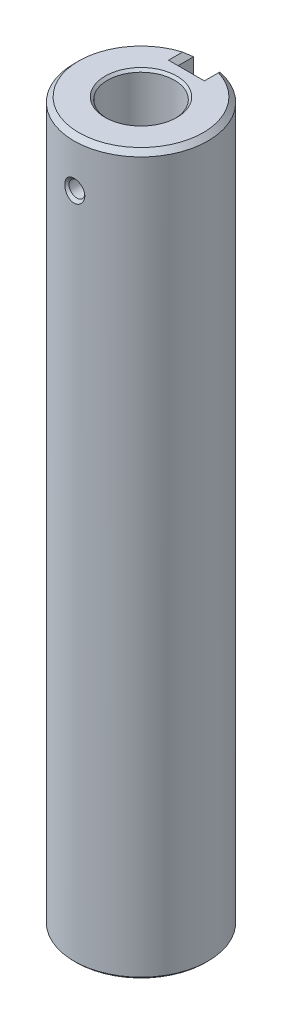
ISO-10303-21;
HEADER;
FILE_DESCRIPTION(('STEP AP214'),'2;1');
FILE_NAME('part.step','',(''),(''),'','','');
FILE_SCHEMA(('AUTOMOTIVE_DESIGN { 1 0 10303 214 1 1 1 1 }'));
ENDSEC;
DATA;
#1=APPLICATION_CONTEXT('core data for automotive mechanical design processes');
#2=APPLICATION_PROTOCOL_DEFINITION('international standard','automotive_design',2000,#1);
#3=PRODUCT_CONTEXT('',#1,'mechanical');
#4=PRODUCT('Part','Part','',(#3));
#5=PRODUCT_RELATED_PRODUCT_CATEGORY('part','',(#4));
#6=PRODUCT_DEFINITION_FORMATION('','',#4);
#7=PRODUCT_DEFINITION_CONTEXT('part definition',#1,'design');
#8=PRODUCT_DEFINITION('design','',#6,#7);
#9=PRODUCT_DEFINITION_SHAPE('','',#8);
#10=(LENGTH_UNIT() NAMED_UNIT(*) SI_UNIT(.MILLI.,.METRE.));
#11=(NAMED_UNIT(*) PLANE_ANGLE_UNIT() SI_UNIT($,.RADIAN.));
#12=(NAMED_UNIT(*) SI_UNIT($,.STERADIAN.) SOLID_ANGLE_UNIT());
#13=UNCERTAINTY_MEASURE_WITH_UNIT(LENGTH_MEASURE(1.E-05),#10,'distance_accuracy_value','');
#14=(GEOMETRIC_REPRESENTATION_CONTEXT(3) GLOBAL_UNCERTAINTY_ASSIGNED_CONTEXT((#13)) GLOBAL_UNIT_ASSIGNED_CONTEXT((#10,
#11,#12)) REPRESENTATION_CONTEXT('',''));
#15=CARTESIAN_POINT('',(0.,0.,0.));
#16=DIRECTION('',(0.,0.,1.));
#17=DIRECTION('',(1.,0.,0.));
#18=AXIS2_PLACEMENT_3D('',#15,#16,#17);
#19=CARTESIAN_POINT('',(0.,150.,0.));
#20=DIRECTION('',(0.,-1.,0.));
#21=DIRECTION('',(0.,0.,-1.));
#22=AXIS2_PLACEMENT_3D('',#19,#20,#21);
#23=CYLINDRICAL_SURFACE('',#22,14.);
#24=CARTESIAN_POINT('',(-1.53135776022729,138.468176963126,13.9159959942111));
#25=CARTESIAN_POINT('',(-1.60127764476214,138.548957642016,13.9083021061078));
#26=CARTESIAN_POINT('',(-1.66533345422651,138.634852905506,13.9007208756863));
#27=CARTESIAN_POINT('',(-1.78077358937562,138.814893823729,13.8864046729967));
#28=CARTESIAN_POINT('',(-1.8321464533701,138.909046837703,13.8796704688696));
#29=CARTESIAN_POINT('',(-1.92996888788323,139.12211198582,13.8664386029846));
#30=CARTESIAN_POINT('',(-1.97363320464747,139.242331559543,13.860228447879));
#31=CARTESIAN_POINT('',(-2.04115702723578,139.488323793423,13.8504456580711));
#32=CARTESIAN_POINT('',(-2.06500845486323,139.614098696633,13.8468740992544));
#33=CARTESIAN_POINT('',(-2.09298715096072,139.872668446938,13.8426739939634));
#34=CARTESIAN_POINT('',(-2.09634077625566,140.005549620874,13.8421608995439));
#35=CARTESIAN_POINT('',(-2.08118716452947,140.270034328525,13.8444470601918));
#36=CARTESIAN_POINT('',(-2.06267853304951,140.401637780201,13.8472465265471));
#37=CARTESIAN_POINT('',(-2.00385336318689,140.661192268973,13.8558817867143));
#38=CARTESIAN_POINT('',(-1.96331849847957,140.789093005199,13.8617479555388));
#39=CARTESIAN_POINT('',(-1.8610882733508,141.036032734745,13.8758422940061));
#40=CARTESIAN_POINT('',(-1.7993923636138,141.15507149792,13.8840705249645));
#41=CARTESIAN_POINT('',(-1.65748223155585,141.378306469293,13.9017175784515));
#42=CARTESIAN_POINT('',(-1.5776406549037,141.482740982984,13.9111109155746));
#43=CARTESIAN_POINT('',(-1.40059493770745,141.675703388028,13.9300476949973));
#44=CARTESIAN_POINT('',(-1.30339610890894,141.764236129135,13.9395910905627));
#45=CARTESIAN_POINT('',(-1.0999170018714,141.917452612588,13.9570775487696));
#46=CARTESIAN_POINT('',(-0.994428442648154,141.983178961701,13.9650797110893));
#47=CARTESIAN_POINT('',(-0.773133020119913,142.094348315229,13.9790739984405));
#48=CARTESIAN_POINT('',(-0.657332390298212,142.139803474743,13.9850673274803));
#49=CARTESIAN_POINT('',(-0.428327101943259,142.205583837824,13.9938787985151));
#50=CARTESIAN_POINT('',(-0.315607150891731,142.227572179828,13.9969056017207));
#51=CARTESIAN_POINT('',(-0.0880285048525289,142.251367596664,14.0001849305751));
#52=CARTESIAN_POINT('',(0.0268294141370945,142.253181856144,14.0004384438823));
#53=CARTESIAN_POINT('',(0.249211116987518,142.23698461402,13.9982013994123));
#54=CARTESIAN_POINT('',(0.356811134085362,142.219975279489,13.9958495447503));
#55=CARTESIAN_POINT('',(0.567640413666256,142.168445480423,13.9888853894585));
#56=CARTESIAN_POINT('',(0.670869639044375,142.133924867263,13.9842730696431));
#57=CARTESIAN_POINT('',(0.871296729335743,142.048301486374,13.9732254623816));
#58=CARTESIAN_POINT('',(0.968423934262403,141.997036303114,13.9667724014763));
#59=CARTESIAN_POINT('',(1.1532880828759,141.879856250496,13.9527250532927));
#60=CARTESIAN_POINT('',(1.24102283340762,141.81393797062,13.9451305004649));
#61=CARTESIAN_POINT('',(1.41028376270478,141.665167417869,13.9290618468448));
#62=CARTESIAN_POINT('',(1.49112308764274,141.581537223889,13.9205623107645));
#63=CARTESIAN_POINT('',(1.63874712127917,141.402652045635,13.903957675865));
#64=CARTESIAN_POINT('',(1.70552733334932,141.307393357478,13.8958527038773));
#65=CARTESIAN_POINT('',(1.82818769716662,141.100538358997,13.8802679531317));
#66=CARTESIAN_POINT('',(1.88292721894083,140.988258352901,13.8728760468477));
#67=CARTESIAN_POINT('',(1.97394595926302,140.756338490784,13.8602184306113));
#68=CARTESIAN_POINT('',(2.01022039243926,140.636696735905,13.854953271895));
#69=CARTESIAN_POINT('',(2.06505190998251,140.386869742714,13.8468906918943));
#70=CARTESIAN_POINT('',(2.08260411797717,140.256458525243,13.8442337938247));
#71=CARTESIAN_POINT('',(2.09627245927023,139.994484997263,13.8421706416678));
#72=CARTESIAN_POINT('',(2.09238539951781,139.862922518205,13.842764871786));
#73=CARTESIAN_POINT('',(2.06295333228332,139.599656131464,13.8471820432034));
#74=CARTESIAN_POINT('',(2.03698336478367,139.468000450473,13.8510683307278));
#75=CARTESIAN_POINT('',(1.96331839276871,139.211010689411,13.8617010339261));
#76=CARTESIAN_POINT('',(1.91562206802214,139.085676994017,13.8684476234084));
#77=CARTESIAN_POINT('',(1.79996028300475,138.846192891427,13.8839297212903));
#78=CARTESIAN_POINT('',(1.73217434096817,138.731954861105,13.8926474587093));
#79=CARTESIAN_POINT('',(1.57760105894847,138.517196760224,13.9110463033582));
#80=CARTESIAN_POINT('',(1.49081689892043,138.416674398477,13.9207272492169));
#81=CARTESIAN_POINT('',(1.30437387879809,138.237031205091,13.9394042422191));
#82=CARTESIAN_POINT('',(1.2054197936225,138.157181839928,13.9484119055677));
#83=CARTESIAN_POINT('',(0.994544195131819,138.016773832754,13.9650285578943));
#84=CARTESIAN_POINT('',(0.882629862947548,137.956204576934,13.972638315448));
#85=CARTESIAN_POINT('',(0.657880600130233,137.860850041201,13.9849528210744));
#86=CARTESIAN_POINT('',(0.545722145073134,137.824492756417,13.9898304105963));
#87=CARTESIAN_POINT('',(0.316638237442721,137.772444103654,13.9968866996364));
#88=CARTESIAN_POINT('',(0.199715209735978,137.756742355457,13.9990667547388));
#89=CARTESIAN_POINT('',(-0.0273628075260393,137.747082906316,14.0004037892334));
#90=CARTESIAN_POINT('',(-0.137461322916733,137.751772604662,13.9997488333666));
#91=CARTESIAN_POINT('',(-0.355247070846229,137.779643843199,13.995915803131));
#92=CARTESIAN_POINT('',(-0.462934261837606,137.802825701761,13.9927376853221));
#93=CARTESIAN_POINT('',(-0.671693957348671,137.866335623105,13.9842639363403));
#94=CARTESIAN_POINT('',(-0.772826536229987,137.906470843267,13.9789921594535));
#95=CARTESIAN_POINT('',(-0.967253953326417,138.002324603407,13.9668862467392));
#96=CARTESIAN_POINT('',(-1.06055160164878,138.058037524917,13.9600526743723));
#97=CARTESIAN_POINT('',(-1.21943577141882,138.170492445145,13.9469709891212));
#98=CARTESIAN_POINT('',(-1.28681335132365,138.224754034039,13.9408833789934));
#99=CARTESIAN_POINT('',(-1.41452195716676,138.34095723969,13.9285046220588));
#100=CARTESIAN_POINT('',(-1.47485461442085,138.402897071605,13.9222135228042));
#101=CARTESIAN_POINT('',(-1.53135776022729,138.468176963126,13.9159959942111));
#102=B_SPLINE_CURVE_WITH_KNOTS('',3,(#24,#25,#26,#27,#28,#29,#30,#31,#32,#33,#34,#35,#36,#37,
#38,#39,#40,#41,#42,#43,#44,#45,#46,#47,#48,#49,#50,#51,#52,#53,#54,#55,#56,#57,#58,#59,#60,#61,
#62,#63,#64,#65,#66,#67,#68,#69,#70,#71,#72,#73,#74,#75,#76,#77,#78,#79,#80,#81,#82,#83,#84,#85,
#86,#87,#88,#89,#90,#91,#92,#93,#94,#95,#96,#97,#98,#99,#100,#101),.UNSPECIFIED.,.T.,.F.,(4,2,2,
2,2,2,2,2,2,2,2,2,2,2,2,2,2,2,2,2,2,2,2,2,2,2,2,2,2,2,2,2,2,2,2,2,2,2,4),(0.,0.321111598311163,
0.642512334418354,1.02491696386992,1.40747743256409,1.80439185218487,2.201331589901,
2.60227957691264,3.00323797284469,3.3966065032665,3.78985485890881,4.16151011353402,
4.53294221399786,4.87582246978047,5.21858061081795,5.54393186724936,5.86928588512925,
6.19789438592273,6.52657945080125,6.87495603822549,7.22344388075731,7.5971862908592,
7.97102550997305,8.36405163147754,8.75713628978807,9.15796118760687,9.55881044533817,
9.95618054845073,10.3534841898444,10.7338858266659,11.1140776866143,11.4662331807764,
11.8182116352824,12.1472118287886,12.4762176866548,12.8015778480361,13.1268208115693,
13.3863753902016,13.6458697469245),.UNSPECIFIED.);
#103=CARTESIAN_POINT('',(-1.53135776022729,138.468176963126,13.9159959942111));
#104=VERTEX_POINT('',#103);
#105=EDGE_CURVE('E245',#104,#104,#102,.T.);
#106=ORIENTED_EDGE('',*,*,#105,.T.);
#107=EDGE_LOOP('',(#106));
#108=FACE_BOUND('',#107,.T.);
#109=CARTESIAN_POINT('',(0.,0.499999999999973,0.));
#110=DIRECTION('',(0.,1.,0.));
#111=DIRECTION('',(0.,0.,1.));
#112=AXIS2_PLACEMENT_3D('',#109,#110,#111);
#113=CIRCLE('',#112,14.);
#114=CARTESIAN_POINT('',(-3.25000000000003,0.499999999999973,-13.6175438313963));
#115=VERTEX_POINT('',#114);
#116=CARTESIAN_POINT('',(3.25000000000003,0.499999999999973,-13.6175438313963));
#117=VERTEX_POINT('',#116);
#118=EDGE_CURVE('E141',#115,#117,#113,.T.);
#119=ORIENTED_EDGE('',*,*,#118,.T.);
#120=CARTESIAN_POINT('',(0.,3.75,0.));
#121=DIRECTION('',(0.707106781186548,0.707106781186547,0.));
#122=DIRECTION('',(0.707106781186547,-0.707106781186548,0.));
#123=AXIS2_PLACEMENT_3D('',#120,#121,#122);
#124=ELLIPSE('',#123,19.7989898732233,14.);
#125=CARTESIAN_POINT('',(2.75,1.,-13.7272539132923));
#126=VERTEX_POINT('',#125);
#127=EDGE_CURVE('E314',#117,#126,#124,.T.);
#128=ORIENTED_EDGE('',*,*,#127,.T.);
#129=DIRECTION('',(0.,-1.,0.));
#130=VECTOR('',#129,1.);
#131=CARTESIAN_POINT('',(2.75,150.,-13.7272539132923));
#132=LINE('',#131,#130);
#133=CARTESIAN_POINT('',(2.75,149.,-13.7272539132923));
#134=VERTEX_POINT('',#133);
#135=EDGE_CURVE('E140',#134,#126,#132,.T.);
#136=ORIENTED_EDGE('',*,*,#135,.F.);
#137=CARTESIAN_POINT('',(0.,149.,0.));
#138=DIRECTION('',(0.,1.,0.));
#139=DIRECTION('',(0.,0.,1.));
#140=AXIS2_PLACEMENT_3D('',#137,#138,#139);
#141=CIRCLE('',#140,14.);
#142=CARTESIAN_POINT('',(-2.75,149.,-13.7272539132923));
#143=VERTEX_POINT('',#142);
#144=EDGE_CURVE('E120',#134,#143,#141,.F.);
#145=ORIENTED_EDGE('',*,*,#144,.T.);
#146=DIRECTION('',(0.,-1.,0.));
#147=VECTOR('',#146,1.);
#148=CARTESIAN_POINT('',(-2.75,150.,-13.7272539132923));
#149=LINE('',#148,#147);
#150=CARTESIAN_POINT('',(-2.75,1.,-13.7272539132923));
#151=VERTEX_POINT('',#150);
#152=EDGE_CURVE('E128',#151,#143,#149,.F.);
#153=ORIENTED_EDGE('',*,*,#152,.F.);
#154=CARTESIAN_POINT('',(0.,3.75,0.));
#155=DIRECTION('',(-0.707106781186547,0.707106781186547,0.));
#156=DIRECTION('',(-0.707106781186548,-0.707106781186548,0.));
#157=AXIS2_PLACEMENT_3D('',#154,#155,#156);
#158=ELLIPSE('',#157,19.7989898732233,14.);
#159=EDGE_CURVE('E215',#151,#115,#158,.T.);
#160=ORIENTED_EDGE('',*,*,#159,.T.);
#161=EDGE_LOOP('',(#119,#128,#136,#145,#153,#160));
#162=FACE_BOUND('',#161,.T.);
#163=ADVANCED_FACE('F36',(#108,#162),#23,.T.);
#164=CARTESIAN_POINT('',(0.,150.,0.));
#165=DIRECTION('',(0.,1.,0.));
#166=DIRECTION('',(0.,0.,1.));
#167=AXIS2_PLACEMENT_3D('',#164,#165,#166);
#168=PLANE('',#167);
#169=CARTESIAN_POINT('',(0.,150.,0.));
#170=DIRECTION('',(0.,1.,0.));
#171=DIRECTION('',(0.,0.,1.));
#172=AXIS2_PLACEMENT_3D('',#169,#170,#171);
#173=CIRCLE('',#172,13.);
#174=CARTESIAN_POINT('',(-3.74999999999997,150.,-12.4473892845046));
#175=VERTEX_POINT('',#174);
#176=CARTESIAN_POINT('',(3.74999999999997,150.,-12.4473892845046));
#177=VERTEX_POINT('',#176);
#178=EDGE_CURVE('E122',#175,#177,#173,.T.);
#179=ORIENTED_EDGE('',*,*,#178,.T.);
#180=DIRECTION('',(0.,0.,1.));
#181=VECTOR('',#180,1.);
#182=CARTESIAN_POINT('',(3.74999999999997,150.,-10.5));
#183=LINE('',#182,#181);
#184=CARTESIAN_POINT('',(3.74999999999997,150.,-9.50000000000003));
#185=VERTEX_POINT('',#184);
#186=EDGE_CURVE('E146',#177,#185,#183,.T.);
#187=ORIENTED_EDGE('',*,*,#186,.T.);
#188=DIRECTION('',(-1.,0.,0.));
#189=VECTOR('',#188,1.);
#190=CARTESIAN_POINT('',(-2.75,150.,-9.50000000000003));
#191=LINE('',#190,#189);
#192=CARTESIAN_POINT('',(-3.74999999999997,150.,-9.50000000000003));
#193=VERTEX_POINT('',#192);
#194=EDGE_CURVE('E61',#185,#193,#191,.T.);
#195=ORIENTED_EDGE('',*,*,#194,.T.);
#196=DIRECTION('',(0.,0.,-1.));
#197=VECTOR('',#196,1.);
#198=CARTESIAN_POINT('',(-3.74999999999997,150.,-12.705805759573));
#199=LINE('',#198,#197);
#200=EDGE_CURVE('E148',#193,#175,#199,.T.);
#201=ORIENTED_EDGE('',*,*,#200,.T.);
#202=EDGE_LOOP('',(#179,#187,#195,#201));
#203=FACE_BOUND('',#202,.T.);
#204=CARTESIAN_POINT('',(0.,150.,0.));
#205=DIRECTION('',(0.,1.,0.));
#206=DIRECTION('',(0.,0.,1.));
#207=AXIS2_PLACEMENT_3D('',#204,#205,#206);
#208=CIRCLE('',#207,7.5);
#209=CARTESIAN_POINT('',(0.,150.,7.5));
#210=VERTEX_POINT('',#209);
#211=EDGE_CURVE('E300',#210,#210,#208,.T.);
#212=ORIENTED_EDGE('',*,*,#211,.F.);
#213=EDGE_LOOP('',(#212));
#214=FACE_BOUND('',#213,.T.);
#215=ADVANCED_FACE('F237',(#203,#214),#168,.T.);
#216=CARTESIAN_POINT('',(0.,0.,0.));
#217=DIRECTION('',(0.,1.,0.));
#218=DIRECTION('',(0.,0.,1.));
#219=AXIS2_PLACEMENT_3D('',#216,#217,#218);
#220=PLANE('',#219);
#221=CARTESIAN_POINT('',(0.,0.,0.));
#222=DIRECTION('',(0.,-1.,0.));
#223=DIRECTION('',(0.,0.,-1.));
#224=AXIS2_PLACEMENT_3D('',#221,#222,#223);
#225=CIRCLE('',#224,3.5);
#226=CARTESIAN_POINT('',(0.,0.,-3.5));
#227=VERTEX_POINT('',#226);
#228=EDGE_CURVE('E265',#227,#227,#225,.T.);
#229=ORIENTED_EDGE('',*,*,#228,.F.);
#230=EDGE_LOOP('',(#229));
#231=FACE_BOUND('',#230,.T.);
#232=DIRECTION('',(1.,0.,0.));
#233=VECTOR('',#232,1.);
#234=CARTESIAN_POINT('',(0.,0.,-9.5));
#235=LINE('',#234,#233);
#236=CARTESIAN_POINT('',(-3.75,0.,-9.5));
#237=VERTEX_POINT('',#236);
#238=CARTESIAN_POINT('',(3.75,0.,-9.5));
#239=VERTEX_POINT('',#238);
#240=EDGE_CURVE('E251',#237,#239,#235,.T.);
#241=ORIENTED_EDGE('',*,*,#240,.T.);
#242=DIRECTION('',(0.,0.,-1.));
#243=VECTOR('',#242,1.);
#244=CARTESIAN_POINT('',(3.75,0.,0.));
#245=LINE('',#244,#243);
#246=CARTESIAN_POINT('',(3.75,0.,-12.968712349343));
#247=VERTEX_POINT('',#246);
#248=EDGE_CURVE('E327',#239,#247,#245,.T.);
#249=ORIENTED_EDGE('',*,*,#248,.T.);
#250=CARTESIAN_POINT('',(0.,0.,0.));
#251=DIRECTION('',(0.,1.,0.));
#252=DIRECTION('',(0.,0.,1.));
#253=AXIS2_PLACEMENT_3D('',#250,#251,#252);
#254=CIRCLE('',#253,13.5);
#255=CARTESIAN_POINT('',(-3.75,0.,-12.968712349343));
#256=VERTEX_POINT('',#255);
#257=EDGE_CURVE('E248',#247,#256,#254,.F.);
#258=ORIENTED_EDGE('',*,*,#257,.T.);
#259=DIRECTION('',(0.,0.,1.));
#260=VECTOR('',#259,1.);
#261=CARTESIAN_POINT('',(-3.75,0.,0.));
#262=LINE('',#261,#260);
#263=EDGE_CURVE('E326',#256,#237,#262,.T.);
#264=ORIENTED_EDGE('',*,*,#263,.T.);
#265=EDGE_LOOP('',(#241,#249,#258,#264));
#266=FACE_BOUND('',#265,.T.);
#267=ADVANCED_FACE('F188',(#231,#266),#220,.F.);
#268=CARTESIAN_POINT('',(0.,150.,0.));
#269=DIRECTION('',(0.,-1.,0.));
#270=DIRECTION('',(0.,0.,-1.));
#271=AXIS2_PLACEMENT_3D('',#268,#269,#270);
#272=CONICAL_SURFACE('',#271,13.,0.785398163397456);
#273=ORIENTED_EDGE('',*,*,#144,.F.);
#274=CARTESIAN_POINT('',(2.75,149.,-13.7272539132923));
#275=CARTESIAN_POINT('',(2.83510961051727,149.085109610517,-13.62340230328));
#276=CARTESIAN_POINT('',(2.91980810439673,149.169808104397,-13.5188754934495));
#277=CARTESIAN_POINT('',(3.08832365640779,149.338323656408,-13.3084458791584));
#278=CARTESIAN_POINT('',(3.17214084304927,149.422140843049,-13.202543280491));
#279=CARTESIAN_POINT('',(3.33886094330728,149.588860943307,-12.9893043121115));
#280=CARTESIAN_POINT('',(3.42176384415753,149.671763844158,-12.8819679224255));
#281=CARTESIAN_POINT('',(3.58661450958442,149.836614509584,-12.6658040019865));
#282=CARTESIAN_POINT('',(3.66856213105498,149.918562131055,-12.5569762530001));
#283=CARTESIAN_POINT('',(3.74999999999998,150.,-12.4473892845046));
#284=B_SPLINE_CURVE_WITH_KNOTS('',3,(#274,#275,#276,#277,#278,#279,#280,#281,#282,#283),
.UNSPECIFIED.,.F.,.F.,(4,2,2,2,4),(0.,0.476918093704945,0.953765652189666,1.43061986054424,
1.90754460924953),.UNSPECIFIED.);
#285=EDGE_CURVE('E124',#134,#177,#284,.T.);
#286=ORIENTED_EDGE('',*,*,#285,.T.);
#287=ORIENTED_EDGE('',*,*,#178,.F.);
#288=CARTESIAN_POINT('',(-3.74999999999997,150.,-12.4473892845046));
#289=CARTESIAN_POINT('',(-3.66856213105499,149.918562131055,-12.5569762530001));
#290=CARTESIAN_POINT('',(-3.58661450958442,149.836614509584,-12.6658040019865));
#291=CARTESIAN_POINT('',(-3.42176384415752,149.671763844158,-12.8819679224255));
#292=CARTESIAN_POINT('',(-3.33886094330727,149.588860943307,-12.9893043121115));
#293=CARTESIAN_POINT('',(-3.17214084304926,149.422140843049,-13.202543280491));
#294=CARTESIAN_POINT('',(-3.08832365640777,149.338323656408,-13.3084458791584));
#295=CARTESIAN_POINT('',(-2.91980810439671,149.169808104397,-13.5188754934495));
#296=CARTESIAN_POINT('',(-2.83510961051726,149.085109610517,-13.62340230328));
#297=CARTESIAN_POINT('',(-2.74999999999998,149.,-13.7272539132923));
#298=B_SPLINE_CURVE_WITH_KNOTS('',3,(#288,#289,#290,#291,#292,#293,#294,#295,#296,#297),
.UNSPECIFIED.,.F.,.F.,(4,2,2,2,4),(0.,0.476924748705315,0.953778957059881,1.43062651554463,
1.90754460924954),.UNSPECIFIED.);
#299=EDGE_CURVE('E117',#175,#143,#298,.T.);
#300=ORIENTED_EDGE('',*,*,#299,.T.);
#301=EDGE_LOOP('',(#273,#286,#287,#300));
#302=FACE_BOUND('',#301,.T.);
#303=ADVANCED_FACE('F118',(#302),#272,.T.);
#304=CARTESIAN_POINT('',(0.,115.,0.));
#305=DIRECTION('',(0.,1.,0.));
#306=DIRECTION('',(0.,0.,1.));
#307=AXIS2_PLACEMENT_3D('',#304,#305,#306);
#308=CONICAL_SURFACE('',#307,6.99999999999999,1.02974425867665);
#309=CARTESIAN_POINT('',(0.,110.793975666807,0.));
#310=VERTEX_POINT('',#309);
#311=VERTEX_LOOP('',#310);
#312=FACE_BOUND('',#311,.T.);
#313=CARTESIAN_POINT('',(0.,115.,0.));
#314=DIRECTION('',(0.,1.,0.));
#315=DIRECTION('',(0.,0.,1.));
#316=AXIS2_PLACEMENT_3D('',#313,#314,#315);
#317=CIRCLE('',#316,6.99999999999999);
#318=CARTESIAN_POINT('',(0.,115.,6.99999999999999));
#319=VERTEX_POINT('',#318);
#320=EDGE_CURVE('E304',#319,#319,#317,.T.);
#321=ORIENTED_EDGE('',*,*,#320,.T.);
#322=EDGE_LOOP('',(#321));
#323=FACE_BOUND('',#322,.T.);
#324=ADVANCED_FACE('F187',(#312,#323),#308,.F.);
#325=CARTESIAN_POINT('',(0.,150.,0.));
#326=DIRECTION('',(0.,1.,0.));
#327=DIRECTION('',(0.,0.,1.));
#328=AXIS2_PLACEMENT_3D('',#325,#326,#327);
#329=CYLINDRICAL_SURFACE('',#328,6.99999999999999);
#330=CARTESIAN_POINT('',(0.,138.35,6.99999999999999));
#331=CARTESIAN_POINT('',(0.091328739317613,138.350002843879,6.99999836647251));
#332=CARTESIAN_POINT('',(0.182690417283302,138.357608230849,6.99819467849872));
#333=CARTESIAN_POINT('',(0.362806323664359,138.387789901469,6.99117390365259));
#334=CARTESIAN_POINT('',(0.451558855012934,138.410375713275,6.98595464436712));
#335=CARTESIAN_POINT('',(0.623828476855961,138.469761774017,6.97268218331076));
#336=CARTESIAN_POINT('',(0.707351348819682,138.506545992007,6.96463217854925));
#337=CARTESIAN_POINT('',(0.867039208328411,138.593230848715,6.94656095410579));
#338=CARTESIAN_POINT('',(0.943204151262112,138.643131566953,6.93653972247337));
#339=CARTESIAN_POINT('',(1.08742143444221,138.755606821652,6.91541181493804));
#340=CARTESIAN_POINT('',(1.15531854158779,138.818377553555,6.90428991213627));
#341=CARTESIAN_POINT('',(1.27972508274132,138.954390409173,6.88231817514456));
#342=CARTESIAN_POINT('',(1.33623336463363,139.027633591022,6.87146836857752));
#343=CARTESIAN_POINT('',(1.43696684618771,139.183690367456,6.85111743990826));
#344=CARTESIAN_POINT('',(1.48102236520304,139.266616250423,6.84163573776828));
#345=CARTESIAN_POINT('',(1.5545098915109,139.438955721702,6.8253150534534));
#346=CARTESIAN_POINT('',(1.58394395433771,139.528368396052,6.81847569983818));
#347=CARTESIAN_POINT('',(1.62683125284545,139.709446972031,6.80836995693016));
#348=CARTESIAN_POINT('',(1.64056162843084,139.801043704224,6.80504168835828));
#349=CARTESIAN_POINT('',(1.6525143545755,139.985296353664,6.80214944752778));
#350=CARTESIAN_POINT('',(1.65073893306961,140.077952116834,6.80258493447764));
#351=CARTESIAN_POINT('',(1.63195247769314,140.259599180796,6.80711518628286));
#352=CARTESIAN_POINT('',(1.61526770664355,140.348626479963,6.81113158544196));
#353=CARTESIAN_POINT('',(1.56765494743683,140.522581519513,6.82224669705885));
#354=CARTESIAN_POINT('',(1.53672604569692,140.607508996556,6.82934560721948));
#355=CARTESIAN_POINT('',(1.46121486998613,140.771748397053,6.84590028619907));
#356=CARTESIAN_POINT('',(1.41651088097455,140.851002169397,6.85537691977425));
#357=CARTESIAN_POINT('',(1.31480384080151,141.001002120948,6.87560701771074));
#358=CARTESIAN_POINT('',(1.25779885989577,141.071746962584,6.88636068228984));
#359=CARTESIAN_POINT('',(1.13140044923304,141.204594797696,6.90826612497408));
#360=CARTESIAN_POINT('',(1.06173067039407,141.266434627954,6.91942110106381));
#361=CARTESIAN_POINT('',(0.912878848692455,141.377599647001,6.94062641864199));
#362=CARTESIAN_POINT('',(0.833696575268982,141.426924532367,6.9506767333447));
#363=CARTESIAN_POINT('',(0.667717693598593,141.511741023479,6.96858169507369));
#364=CARTESIAN_POINT('',(0.580900533100757,141.547193798679,6.97643016161575));
#365=CARTESIAN_POINT('',(0.402313719817366,141.602931553437,6.98900179511063));
#366=CARTESIAN_POINT('',(0.310544909289169,141.623219103878,6.99372549177408));
#367=CARTESIAN_POINT('',(0.126913198899211,141.647657684333,6.99943837162219));
#368=CARTESIAN_POINT('',(0.0351005767602226,141.652167596699,7.00051059686151));
#369=CARTESIAN_POINT('',(-0.147966685501655,141.645901723631,6.99903444009397));
#370=CARTESIAN_POINT('',(-0.239221369368363,141.635127152384,6.99648634568226));
#371=CARTESIAN_POINT('',(-0.417362653019775,141.598894920763,6.98810869992011));
#372=CARTESIAN_POINT('',(-0.504290552421114,141.573629486476,6.98232213187252));
#373=CARTESIAN_POINT('',(-0.672672276070128,141.509349349124,6.96811723407211));
#374=CARTESIAN_POINT('',(-0.754125584648712,141.470333353004,6.95969865682289));
#375=CARTESIAN_POINT('',(-0.910700498955395,141.378939577914,6.94096161251793));
#376=CARTESIAN_POINT('',(-0.985698570997655,141.326356139424,6.93061465221503));
#377=CARTESIAN_POINT('',(-1.1259344495591,141.209586680757,6.90921937825114));
#378=CARTESIAN_POINT('',(-1.19117076625592,141.145398892839,6.89817095790025));
#379=CARTESIAN_POINT('',(-1.31148229591091,141.005584944694,6.87632466673188));
#380=CARTESIAN_POINT('',(-1.36630717929422,140.929741387403,6.86553738570699));
#381=CARTESIAN_POINT('',(-1.46244648293611,140.769715207675,6.84570445168463));
#382=CARTESIAN_POINT('',(-1.50376150719304,140.685532958264,6.83665872083342));
#383=CARTESIAN_POINT('',(-1.57141076668763,140.511678725539,6.82142736146697));
#384=CARTESIAN_POINT('',(-1.59783286852026,140.422042473142,6.81522499881538));
#385=CARTESIAN_POINT('',(-1.63519178674544,140.239434344163,6.80635903572141));
#386=CARTESIAN_POINT('',(-1.64613154940224,140.146463105679,6.80369476199233));
#387=CARTESIAN_POINT('',(-1.65207449167986,139.962359924164,6.80225382726604));
#388=CARTESIAN_POINT('',(-1.64747616169189,139.871241386899,6.80337995460539));
#389=CARTESIAN_POINT('',(-1.62337546677893,139.691117636333,6.80917049161346));
#390=CARTESIAN_POINT('',(-1.6038733396724,139.602112389335,6.81383484482305));
#391=CARTESIAN_POINT('',(-1.55072477614989,139.429119893937,6.82612522897375));
#392=CARTESIAN_POINT('',(-1.51714519678737,139.345111042249,6.83373724790253));
#393=CARTESIAN_POINT('',(-1.43684939858625,139.18386348852,6.85106877692284));
#394=CARTESIAN_POINT('',(-1.39013156490447,139.106625620245,6.86078854604758));
#395=CARTESIAN_POINT('',(-1.28360204537891,138.959168348297,6.88152384189011));
#396=CARTESIAN_POINT('',(-1.22351026298737,138.889154768895,6.89256431174074));
#397=CARTESIAN_POINT('',(-1.09249493531383,138.76007516111,6.91453965388042));
#398=CARTESIAN_POINT('',(-1.02156885982584,138.701011697134,6.92547450086676));
#399=CARTESIAN_POINT('',(-0.869562734220024,138.59461714467,6.94620969725689));
#400=CARTESIAN_POINT('',(-0.788341489140673,138.547483546436,6.95598967744617));
#401=CARTESIAN_POINT('',(-0.618909771082382,138.467613790428,6.97310375804726));
#402=CARTESIAN_POINT('',(-0.530704778601504,138.434866472623,6.98043975328752));
#403=CARTESIAN_POINT('',(-0.368778884805452,138.390025779499,6.99064750922865));
#404=CARTESIAN_POINT('',(-0.295881946838862,138.375046708784,6.99413174237216));
#405=CARTESIAN_POINT('',(-0.148663891408634,138.355032956133,6.99880858473133));
#406=CARTESIAN_POINT('',(-0.074342858583861,138.349997685043,7.00000132971398));
#407=CARTESIAN_POINT('',(0.,138.35,6.99999999999999));
#408=B_SPLINE_CURVE_WITH_KNOTS('',3,(#330,#331,#332,#333,#334,#335,#336,#337,#338,#339,#340,
#341,#342,#343,#344,#345,#346,#347,#348,#349,#350,#351,#352,#353,#354,#355,#356,#357,#358,#359,
#360,#361,#362,#363,#364,#365,#366,#367,#368,#369,#370,#371,#372,#373,#374,#375,#376,#377,#378,
#379,#380,#381,#382,#383,#384,#385,#386,#387,#388,#389,#390,#391,#392,#393,#394,#395,#396,#397,
#398,#399,#400,#401,#402,#403,#404,#405,#406,#407),.UNSPECIFIED.,.T.,.F.,(4,2,2,2,2,2,2,2,2,2,2,
2,2,2,2,2,2,2,2,2,2,2,2,2,2,2,2,2,2,2,2,2,2,2,2,2,2,2,4),(0.,0.273713930465041,
0.547602121208311,0.821181974218392,1.09476348584583,1.37287554367489,1.65101572175226,
1.93278083587446,2.21450632727554,2.49117922951627,2.76781237894396,3.03853628105218,
3.30927754913054,3.58248319512939,3.85573173204489,4.13587649000042,4.41602803938652,
4.69695826763981,4.97784086042082,5.25229133365969,5.52672000600245,5.79758981692427,
6.0684851062802,6.34375631656427,6.61906949551373,6.90033819981436,7.18159432744311,
7.46117322376551,7.74069890951607,8.01311084713951,8.28551843800224,8.55664670189886,
8.82780830516571,9.10529722607672,9.3828510502136,9.66473658497748,9.946403061706,
10.1692231938146,10.3920301237803),.UNSPECIFIED.);
#409=CARTESIAN_POINT('',(0.,138.35,6.99999999999999));
#410=VERTEX_POINT('',#409);
#411=EDGE_CURVE('E259',#410,#410,#408,.T.);
#412=ORIENTED_EDGE('',*,*,#411,.T.);
#413=EDGE_LOOP('',(#412));
#414=FACE_BOUND('',#413,.T.);
#415=ORIENTED_EDGE('',*,*,#320,.F.);
#416=EDGE_LOOP('',(#415));
#417=FACE_BOUND('',#416,.T.);
#418=CARTESIAN_POINT('',(0.,149.5,0.));
#419=DIRECTION('',(0.,1.,0.));
#420=DIRECTION('',(0.,0.,1.));
#421=AXIS2_PLACEMENT_3D('',#418,#419,#420);
#422=CIRCLE('',#421,7.);
#423=CARTESIAN_POINT('',(0.,149.5,7.));
#424=VERTEX_POINT('',#423);
#425=EDGE_CURVE('E297',#424,#424,#422,.T.);
#426=ORIENTED_EDGE('',*,*,#425,.T.);
#427=EDGE_LOOP('',(#426));
#428=FACE_BOUND('',#427,.T.);
#429=ADVANCED_FACE('F267',(#414,#417,#428),#329,.F.);
#430=CARTESIAN_POINT('',(0.,150.,0.));
#431=DIRECTION('',(0.,1.,0.));
#432=DIRECTION('',(0.,0.,1.));
#433=AXIS2_PLACEMENT_3D('',#430,#431,#432);
#434=CONICAL_SURFACE('',#433,7.5,0.785398163397452);
#435=ORIENTED_EDGE('',*,*,#425,.F.);
#436=EDGE_LOOP('',(#435));
#437=FACE_BOUND('',#436,.T.);
#438=ORIENTED_EDGE('',*,*,#211,.T.);
#439=EDGE_LOOP('',(#438));
#440=FACE_BOUND('',#439,.T.);
#441=ADVANCED_FACE('F197',(#437,#440),#434,.F.);
#442=CARTESIAN_POINT('',(0.,0.499999999999973,0.));
#443=DIRECTION('',(0.,1.,0.));
#444=DIRECTION('',(0.,0.,1.));
#445=AXIS2_PLACEMENT_3D('',#442,#443,#444);
#446=CONICAL_SURFACE('',#445,14.,0.78539816339745);
#447=ORIENTED_EDGE('',*,*,#257,.F.);
#448=CARTESIAN_POINT('',(3.75,0.,-12.968712349343));
#449=CARTESIAN_POINT('',(3.66759619171605,0.0824038082839461,-13.0782837026362));
#450=CARTESIAN_POINT('',(3.58472759259776,0.165272407402243,-13.1871387053037));
#451=CARTESIAN_POINT('',(3.41806092468186,0.331939075318138,-13.4034158640628));
#452=CARTESIAN_POINT('',(3.3342628571335,0.415737142866499,-13.5108380220797));
#453=CARTESIAN_POINT('',(3.25000000000003,0.499999999999972,-13.6175438313963));
#454=B_SPLINE_CURVE_WITH_KNOTS('',3,(#448,#449,#450,#451,#452,#453),.UNSPECIFIED.,.F.,.F.,(4,2,
4),(0.,0.479848298328368,0.959695951802099),.UNSPECIFIED.);
#455=EDGE_CURVE('E210',#247,#117,#454,.T.);
#456=ORIENTED_EDGE('',*,*,#455,.T.);
#457=ORIENTED_EDGE('',*,*,#118,.F.);
#458=CARTESIAN_POINT('',(-3.25000000000003,0.499999999999973,-13.6175438313963));
#459=CARTESIAN_POINT('',(-3.3342628571335,0.415737142866499,-13.5108380220797));
#460=CARTESIAN_POINT('',(-3.41806092468186,0.331939075318138,-13.4034158640628));
#461=CARTESIAN_POINT('',(-3.58472759259776,0.165272407402243,-13.1871387053037));
#462=CARTESIAN_POINT('',(-3.66759619171605,0.0824038082839465,-13.0782837026362));
#463=CARTESIAN_POINT('',(-3.75,0.,-12.968712349343));
#464=B_SPLINE_CURVE_WITH_KNOTS('',3,(#458,#459,#460,#461,#462,#463),.UNSPECIFIED.,.F.,.F.,(4,2,
4),(0.,0.479847653473731,0.959695951802099),.UNSPECIFIED.);
#465=EDGE_CURVE('E203',#115,#256,#464,.T.);
#466=ORIENTED_EDGE('',*,*,#465,.T.);
#467=EDGE_LOOP('',(#447,#456,#457,#466));
#468=FACE_BOUND('',#467,.T.);
#469=ADVANCED_FACE('F191',(#468),#446,.T.);
#470=CARTESIAN_POINT('',(0.,25.,0.));
#471=DIRECTION('',(0.,-1.,0.));
#472=DIRECTION('',(0.,0.,-1.));
#473=AXIS2_PLACEMENT_3D('',#470,#471,#472);
#474=CONICAL_SURFACE('',#473,3.49999999999999,1.02974425867665);
#475=CARTESIAN_POINT('',(0.,27.1030121665965,0.));
#476=VERTEX_POINT('',#475);
#477=VERTEX_LOOP('',#476);
#478=FACE_BOUND('',#477,.T.);
#479=CARTESIAN_POINT('',(0.,25.,0.));
#480=DIRECTION('',(0.,-1.,0.));
#481=DIRECTION('',(0.,0.,-1.));
#482=AXIS2_PLACEMENT_3D('',#479,#480,#481);
#483=CIRCLE('',#482,3.49999999999999);
#484=CARTESIAN_POINT('',(0.,25.,-3.49999999999999));
#485=VERTEX_POINT('',#484);
#486=EDGE_CURVE('E302',#485,#485,#483,.T.);
#487=ORIENTED_EDGE('',*,*,#486,.T.);
#488=EDGE_LOOP('',(#487));
#489=FACE_BOUND('',#488,.T.);
#490=ADVANCED_FACE('F196',(#478,#489),#474,.F.);
#491=CARTESIAN_POINT('',(0.,0.,0.));
#492=DIRECTION('',(0.,-1.,0.));
#493=DIRECTION('',(0.,0.,-1.));
#494=AXIS2_PLACEMENT_3D('',#491,#492,#493);
#495=CYLINDRICAL_SURFACE('',#494,3.5);
#496=ORIENTED_EDGE('',*,*,#486,.F.);
#497=EDGE_LOOP('',(#496));
#498=FACE_BOUND('',#497,.T.);
#499=ORIENTED_EDGE('',*,*,#228,.T.);
#500=EDGE_LOOP('',(#499));
#501=FACE_BOUND('',#500,.T.);
#502=ADVANCED_FACE('F277',(#498,#501),#495,.F.);
#503=CARTESIAN_POINT('',(0.,140.,0.));
#504=DIRECTION('',(0.,0.,-1.));
#505=DIRECTION('',(-1.,0.,0.));
#506=AXIS2_PLACEMENT_3D('',#503,#504,#505);
#507=CYLINDRICAL_SURFACE('',#506,1.64999999999999);
#508=CARTESIAN_POINT('',(0.,140.,13.4));
#509=DIRECTION('',(0.,0.,-1.));
#510=DIRECTION('',(-1.,0.,0.));
#511=AXIS2_PLACEMENT_3D('',#508,#509,#510);
#512=CIRCLE('',#511,1.65);
#513=CARTESIAN_POINT('',(-1.65,140.,13.4));
#514=VERTEX_POINT('',#513);
#515=EDGE_CURVE('E134',#514,#514,#512,.T.);
#516=ORIENTED_EDGE('',*,*,#515,.F.);
#517=EDGE_LOOP('',(#516));
#518=FACE_BOUND('',#517,.T.);
#519=ORIENTED_EDGE('',*,*,#411,.F.);
#520=EDGE_LOOP('',(#519));
#521=FACE_BOUND('',#520,.T.);
#522=ADVANCED_FACE('F271',(#518,#521),#507,.F.);
#523=CARTESIAN_POINT('',(0.,140.,13.4));
#524=DIRECTION('',(0.,0.,1.));
#525=DIRECTION('',(1.,0.,0.));
#526=AXIS2_PLACEMENT_3D('',#523,#524,#525);
#527=CONICAL_SURFACE('',#526,1.65,0.78539816339745);
#528=ORIENTED_EDGE('',*,*,#105,.F.);
#529=EDGE_LOOP('',(#528));
#530=FACE_BOUND('',#529,.T.);
#531=ORIENTED_EDGE('',*,*,#515,.T.);
#532=EDGE_LOOP('',(#531));
#533=FACE_BOUND('',#532,.T.);
#534=ADVANCED_FACE('F276',(#530,#533),#527,.F.);
#535=CARTESIAN_POINT('',(2.75,-0.001000000000001,-10.5));
#536=DIRECTION('',(0.,0.,1.));
#537=DIRECTION('',(1.,0.,0.));
#538=AXIS2_PLACEMENT_3D('',#535,#536,#537);
#539=PLANE('',#538);
#540=DIRECTION('',(0.,1.,0.));
#541=VECTOR('',#540,1.);
#542=CARTESIAN_POINT('',(-2.75,-0.001000000000001,-10.5));
#543=LINE('',#542,#541);
#544=CARTESIAN_POINT('',(-2.75,1.,-10.5));
#545=VERTEX_POINT('',#544);
#546=CARTESIAN_POINT('',(-2.75,149.,-10.5));
#547=VERTEX_POINT('',#546);
#548=EDGE_CURVE('E319',#545,#547,#543,.T.);
#549=ORIENTED_EDGE('',*,*,#548,.T.);
#550=DIRECTION('',(1.,0.,0.));
#551=VECTOR('',#550,1.);
#552=CARTESIAN_POINT('',(2.75,149.,-10.5));
#553=LINE('',#552,#551);
#554=CARTESIAN_POINT('',(2.75,149.,-10.5));
#555=VERTEX_POINT('',#554);
#556=EDGE_CURVE('E11',#547,#555,#553,.T.);
#557=ORIENTED_EDGE('',*,*,#556,.T.);
#558=DIRECTION('',(0.,1.,0.));
#559=VECTOR('',#558,1.);
#560=CARTESIAN_POINT('',(2.75,-0.001000000000001,-10.5));
#561=LINE('',#560,#559);
#562=CARTESIAN_POINT('',(2.75,1.,-10.5));
#563=VERTEX_POINT('',#562);
#564=EDGE_CURVE('E135',#563,#555,#561,.T.);
#565=ORIENTED_EDGE('',*,*,#564,.F.);
#566=DIRECTION('',(-1.,0.,0.));
#567=VECTOR('',#566,1.);
#568=CARTESIAN_POINT('',(2.75,1.,-10.5));
#569=LINE('',#568,#567);
#570=EDGE_CURVE('E169',#563,#545,#569,.T.);
#571=ORIENTED_EDGE('',*,*,#570,.T.);
#572=EDGE_LOOP('',(#549,#557,#565,#571));
#573=FACE_BOUND('',#572,.T.);
#574=ADVANCED_FACE('F282',(#573),#539,.F.);
#575=CARTESIAN_POINT('',(2.75,-0.001000000000001,-14.6028394154946));
#576=DIRECTION('',(1.,0.,0.));
#577=DIRECTION('',(0.,0.,-1.));
#578=AXIS2_PLACEMENT_3D('',#575,#576,#577);
#579=PLANE('',#578);
#580=ORIENTED_EDGE('',*,*,#564,.T.);
#581=DIRECTION('',(0.,0.,-1.));
#582=VECTOR('',#581,1.);
#583=CARTESIAN_POINT('',(2.75,149.,-12.705805759573));
#584=LINE('',#583,#582);
#585=EDGE_CURVE('E125',#555,#134,#584,.T.);
#586=ORIENTED_EDGE('',*,*,#585,.T.);
#587=ORIENTED_EDGE('',*,*,#135,.T.);
#588=DIRECTION('',(0.,0.,1.));
#589=VECTOR('',#588,1.);
#590=CARTESIAN_POINT('',(2.75,1.,-14.6028394154946));
#591=LINE('',#590,#589);
#592=EDGE_CURVE('E247',#126,#563,#591,.T.);
#593=ORIENTED_EDGE('',*,*,#592,.T.);
#594=EDGE_LOOP('',(#580,#586,#587,#593));
#595=FACE_BOUND('',#594,.T.);
#596=ADVANCED_FACE('F423',(#595),#579,.F.);
#597=CARTESIAN_POINT('',(-2.75,-0.001000000000001,-14.6028394154946));
#598=DIRECTION('',(-1.,0.,0.));
#599=DIRECTION('',(0.,0.,1.));
#600=AXIS2_PLACEMENT_3D('',#597,#598,#599);
#601=PLANE('',#600);
#602=ORIENTED_EDGE('',*,*,#152,.T.);
#603=DIRECTION('',(0.,0.,1.));
#604=VECTOR('',#603,1.);
#605=CARTESIAN_POINT('',(-2.75,149.,-10.5));
#606=LINE('',#605,#604);
#607=EDGE_CURVE('E46',#143,#547,#606,.T.);
#608=ORIENTED_EDGE('',*,*,#607,.T.);
#609=ORIENTED_EDGE('',*,*,#548,.F.);
#610=DIRECTION('',(0.,0.,-1.));
#611=VECTOR('',#610,1.);
#612=CARTESIAN_POINT('',(-2.75,1.,-14.6028394154946));
#613=LINE('',#612,#611);
#614=EDGE_CURVE('E131',#545,#151,#613,.T.);
#615=ORIENTED_EDGE('',*,*,#614,.T.);
#616=EDGE_LOOP('',(#602,#608,#609,#615));
#617=FACE_BOUND('',#616,.T.);
#618=ADVANCED_FACE('F129',(#617),#601,.F.);
#619=CARTESIAN_POINT('',(-2.75,1.,-14.6028394154946));
#620=DIRECTION('',(-0.707106781186547,0.707106781186547,0.));
#621=DIRECTION('',(-0.707106781186548,-0.707106781186548,0.));
#622=AXIS2_PLACEMENT_3D('',#619,#620,#621);
#623=PLANE('',#622);
#624=ORIENTED_EDGE('',*,*,#159,.F.);
#625=ORIENTED_EDGE('',*,*,#614,.F.);
#626=DIRECTION('',(0.577350269189626,0.577350269189626,-0.577350269189626));
#627=VECTOR('',#626,1.);
#628=CARTESIAN_POINT('',(-1.38238686150181,2.36761313849819,-11.8676131384982));
#629=LINE('',#628,#627);
#630=EDGE_CURVE('E159',#237,#545,#629,.T.);
#631=ORIENTED_EDGE('',*,*,#630,.F.);
#632=ORIENTED_EDGE('',*,*,#263,.F.);
#633=ORIENTED_EDGE('',*,*,#465,.F.);
#634=EDGE_LOOP('',(#624,#625,#631,#632,#633));
#635=FACE_BOUND('',#634,.T.);
#636=ADVANCED_FACE('F223',(#635),#623,.F.);
#637=CARTESIAN_POINT('',(2.75,1.,-10.5));
#638=DIRECTION('',(0.,0.707106781186547,0.707106781186547));
#639=DIRECTION('',(0.,-0.707106781186548,0.707106781186548));
#640=AXIS2_PLACEMENT_3D('',#637,#638,#639);
#641=PLANE('',#640);
#642=ORIENTED_EDGE('',*,*,#630,.T.);
#643=ORIENTED_EDGE('',*,*,#570,.F.);
#644=DIRECTION('',(0.577350269189626,-0.577350269189626,0.577350269189626));
#645=VECTOR('',#644,1.);
#646=CARTESIAN_POINT('',(1.38238686150181,2.36761313849819,-11.8676131384982));
#647=LINE('',#646,#645);
#648=EDGE_CURVE('E157',#239,#563,#647,.F.);
#649=ORIENTED_EDGE('',*,*,#648,.F.);
#650=ORIENTED_EDGE('',*,*,#240,.F.);
#651=EDGE_LOOP('',(#642,#643,#649,#650));
#652=FACE_BOUND('',#651,.T.);
#653=ADVANCED_FACE('F221',(#652),#641,.F.);
#654=CARTESIAN_POINT('',(2.75,1.,-14.6028394154946));
#655=DIRECTION('',(0.707106781186548,0.707106781186547,0.));
#656=DIRECTION('',(-0.707106781186547,0.707106781186548,0.));
#657=AXIS2_PLACEMENT_3D('',#654,#655,#656);
#658=PLANE('',#657);
#659=ORIENTED_EDGE('',*,*,#455,.F.);
#660=ORIENTED_EDGE('',*,*,#248,.F.);
#661=ORIENTED_EDGE('',*,*,#648,.T.);
#662=ORIENTED_EDGE('',*,*,#592,.F.);
#663=ORIENTED_EDGE('',*,*,#127,.F.);
#664=EDGE_LOOP('',(#659,#660,#661,#662,#663));
#665=FACE_BOUND('',#664,.T.);
#666=ADVANCED_FACE('F217',(#665),#658,.F.);
#667=CARTESIAN_POINT('',(-2.75,149.,-14.6028394154946));
#668=DIRECTION('',(0.707106781186548,0.707106781186548,0.));
#669=DIRECTION('',(-0.707106781186548,0.707106781186548,0.));
#670=AXIS2_PLACEMENT_3D('',#667,#668,#669);
#671=PLANE('',#670);
#672=ORIENTED_EDGE('',*,*,#299,.F.);
#673=ORIENTED_EDGE('',*,*,#200,.F.);
#674=DIRECTION('',(-0.577350269189626,0.577350269189626,0.577350269189626));
#675=VECTOR('',#674,1.);
#676=CARTESIAN_POINT('',(-1.38238686150181,147.632386861502,-11.8676131384982));
#677=LINE('',#676,#675);
#678=EDGE_CURVE('E41',#547,#193,#677,.T.);
#679=ORIENTED_EDGE('',*,*,#678,.F.);
#680=ORIENTED_EDGE('',*,*,#607,.F.);
#681=EDGE_LOOP('',(#672,#673,#679,#680));
#682=FACE_BOUND('',#681,.T.);
#683=ADVANCED_FACE('F38',(#682),#671,.T.);
#684=CARTESIAN_POINT('',(2.75,149.,-10.5));
#685=DIRECTION('',(0.,0.707106781186548,-0.707106781186548));
#686=DIRECTION('',(0.,0.707106781186548,0.707106781186548));
#687=AXIS2_PLACEMENT_3D('',#684,#685,#686);
#688=PLANE('',#687);
#689=ORIENTED_EDGE('',*,*,#678,.T.);
#690=ORIENTED_EDGE('',*,*,#194,.F.);
#691=DIRECTION('',(-0.577350269189626,-0.577350269189626,-0.577350269189626));
#692=VECTOR('',#691,1.);
#693=CARTESIAN_POINT('',(1.38238686150181,147.632386861502,-11.8676131384982));
#694=LINE('',#693,#692);
#695=EDGE_CURVE('E151',#555,#185,#694,.F.);
#696=ORIENTED_EDGE('',*,*,#695,.F.);
#697=ORIENTED_EDGE('',*,*,#556,.F.);
#698=EDGE_LOOP('',(#689,#690,#696,#697));
#699=FACE_BOUND('',#698,.T.);
#700=ADVANCED_FACE('F231',(#699),#688,.T.);
#701=CARTESIAN_POINT('',(2.75,149.,-14.6028394154946));
#702=DIRECTION('',(-0.707106781186548,0.707106781186547,0.));
#703=DIRECTION('',(-0.707106781186547,-0.707106781186548,0.));
#704=AXIS2_PLACEMENT_3D('',#701,#702,#703);
#705=PLANE('',#704);
#706=ORIENTED_EDGE('',*,*,#695,.T.);
#707=ORIENTED_EDGE('',*,*,#186,.F.);
#708=ORIENTED_EDGE('',*,*,#285,.F.);
#709=ORIENTED_EDGE('',*,*,#585,.F.);
#710=EDGE_LOOP('',(#706,#707,#708,#709));
#711=FACE_BOUND('',#710,.T.);
#712=ADVANCED_FACE('F228',(#711),#705,.T.);
#713=CLOSED_SHELL('',(#163,#215,#267,#303,#324,#429,#441,#469,#490,#502,#522,#534,#574,#596,
#618,#636,#653,#666,#683,#700,#712));
#714=MANIFOLD_SOLID_BREP('B2',#713);
#715=ADVANCED_BREP_SHAPE_REPRESENTATION('',(#18,#714),#14);
#716=SHAPE_DEFINITION_REPRESENTATION(#9,#715);
ENDSEC;
END-ISO-10303-21;
